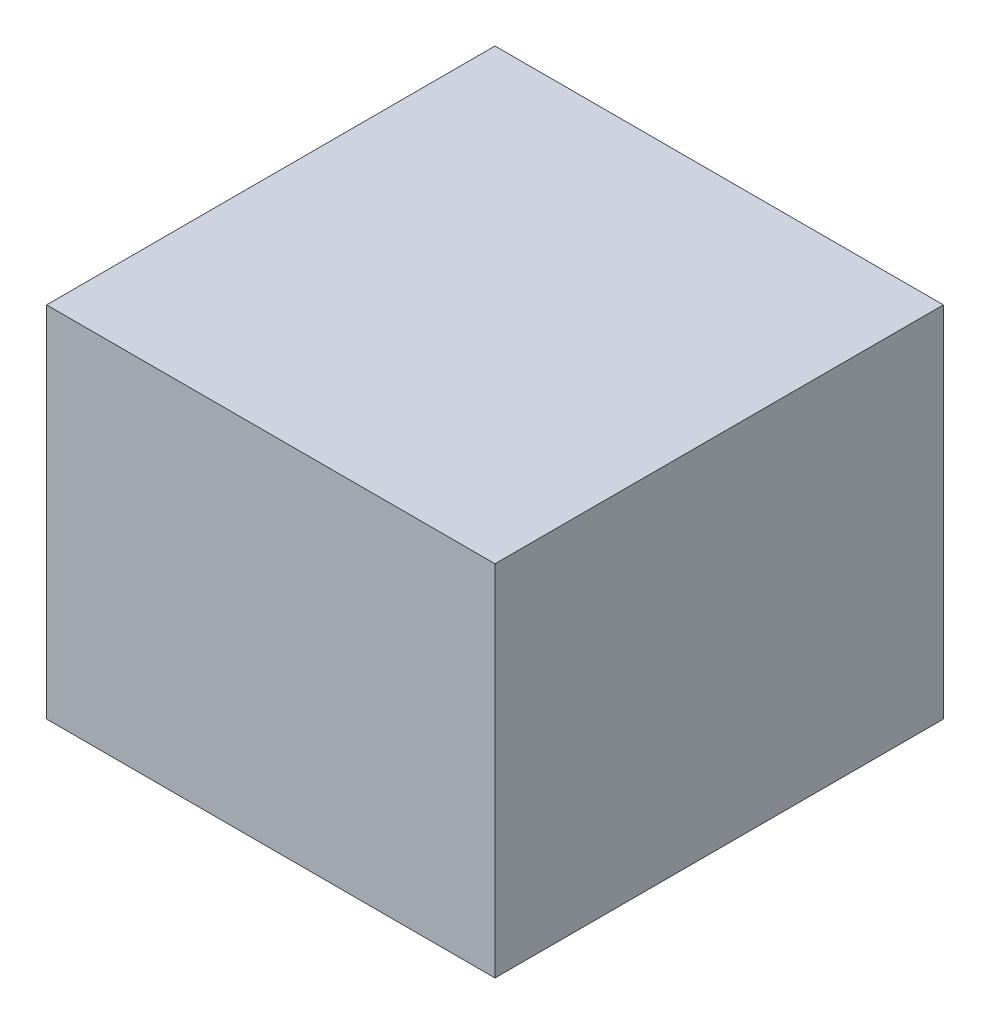
ISO-10303-21;
HEADER;
FILE_DESCRIPTION(('STEP AP214'),'2;1');
FILE_NAME('part.step','',(''),(''),'','','');
FILE_SCHEMA(('AUTOMOTIVE_DESIGN { 1 0 10303 214 1 1 1 1 }'));
ENDSEC;
DATA;
#1=APPLICATION_CONTEXT('core data for automotive mechanical design processes');
#2=APPLICATION_PROTOCOL_DEFINITION('international standard','automotive_design',2000,#1);
#3=PRODUCT_CONTEXT('',#1,'mechanical');
#4=PRODUCT('Part','Part','',(#3));
#5=PRODUCT_RELATED_PRODUCT_CATEGORY('part','',(#4));
#6=PRODUCT_DEFINITION_FORMATION('','',#4);
#7=PRODUCT_DEFINITION_CONTEXT('part definition',#1,'design');
#8=PRODUCT_DEFINITION('design','',#6,#7);
#9=PRODUCT_DEFINITION_SHAPE('','',#8);
#10=(LENGTH_UNIT() NAMED_UNIT(*) SI_UNIT(.MILLI.,.METRE.));
#11=(NAMED_UNIT(*) PLANE_ANGLE_UNIT() SI_UNIT($,.RADIAN.));
#12=(NAMED_UNIT(*) SI_UNIT($,.STERADIAN.) SOLID_ANGLE_UNIT());
#13=UNCERTAINTY_MEASURE_WITH_UNIT(LENGTH_MEASURE(1.E-05),#10,'distance_accuracy_value','');
#14=(GEOMETRIC_REPRESENTATION_CONTEXT(3) GLOBAL_UNCERTAINTY_ASSIGNED_CONTEXT((#13)) GLOBAL_UNIT_ASSIGNED_CONTEXT((#10,
#11,#12)) REPRESENTATION_CONTEXT('',''));
#15=CARTESIAN_POINT('',(0.,0.,0.));
#16=DIRECTION('',(0.,0.,1.));
#17=DIRECTION('',(1.,0.,0.));
#18=AXIS2_PLACEMENT_3D('',#15,#16,#17);
#19=CARTESIAN_POINT('',(0.,80.,0.));
#20=DIRECTION('',(1.,0.,0.));
#21=DIRECTION('',(0.,0.,-1.));
#22=AXIS2_PLACEMENT_3D('',#19,#20,#21);
#23=PLANE('',#22);
#24=DIRECTION('',(0.,0.,1.));
#25=VECTOR('',#24,1.);
#26=CARTESIAN_POINT('',(0.,0.,0.));
#27=LINE('',#26,#25);
#28=CARTESIAN_POINT('',(0.,0.,-100.));
#29=VERTEX_POINT('',#28);
#30=CARTESIAN_POINT('',(0.,0.,0.));
#31=VERTEX_POINT('',#30);
#32=EDGE_CURVE('E76',#29,#31,#27,.T.);
#33=ORIENTED_EDGE('',*,*,#32,.T.);
#34=DIRECTION('',(0.,-1.,0.));
#35=VECTOR('',#34,1.);
#36=CARTESIAN_POINT('',(0.,80.,0.));
#37=LINE('',#36,#35);
#38=CARTESIAN_POINT('',(0.,80.,0.));
#39=VERTEX_POINT('',#38);
#40=EDGE_CURVE('E11',#39,#31,#37,.T.);
#41=ORIENTED_EDGE('',*,*,#40,.F.);
#42=DIRECTION('',(0.,0.,1.));
#43=VECTOR('',#42,1.);
#44=CARTESIAN_POINT('',(0.,80.,0.));
#45=LINE('',#44,#43);
#46=CARTESIAN_POINT('',(0.,80.,-100.));
#47=VERTEX_POINT('',#46);
#48=EDGE_CURVE('E94',#47,#39,#45,.T.);
#49=ORIENTED_EDGE('',*,*,#48,.F.);
#50=DIRECTION('',(0.,-1.,0.));
#51=VECTOR('',#50,1.);
#52=CARTESIAN_POINT('',(0.,80.,-100.));
#53=LINE('',#52,#51);
#54=EDGE_CURVE('E88',#47,#29,#53,.T.);
#55=ORIENTED_EDGE('',*,*,#54,.T.);
#56=EDGE_LOOP('',(#33,#41,#49,#55));
#57=FACE_BOUND('',#56,.T.);
#58=ADVANCED_FACE('F32',(#57),#23,.F.);
#59=CARTESIAN_POINT('',(0.,80.,0.));
#60=DIRECTION('',(0.,0.,-1.));
#61=DIRECTION('',(-1.,0.,0.));
#62=AXIS2_PLACEMENT_3D('',#59,#60,#61);
#63=PLANE('',#62);
#64=DIRECTION('',(1.,0.,0.));
#65=VECTOR('',#64,1.);
#66=CARTESIAN_POINT('',(0.,0.,0.));
#67=LINE('',#66,#65);
#68=CARTESIAN_POINT('',(100.,0.,0.));
#69=VERTEX_POINT('',#68);
#70=EDGE_CURVE('E72',#31,#69,#67,.T.);
#71=ORIENTED_EDGE('',*,*,#70,.T.);
#72=DIRECTION('',(0.,-1.,0.));
#73=VECTOR('',#72,1.);
#74=CARTESIAN_POINT('',(100.,80.,0.));
#75=LINE('',#74,#73);
#76=CARTESIAN_POINT('',(100.,80.,0.));
#77=VERTEX_POINT('',#76);
#78=EDGE_CURVE('E39',#77,#69,#75,.T.);
#79=ORIENTED_EDGE('',*,*,#78,.F.);
#80=DIRECTION('',(1.,0.,0.));
#81=VECTOR('',#80,1.);
#82=CARTESIAN_POINT('',(0.,80.,0.));
#83=LINE('',#82,#81);
#84=EDGE_CURVE('E84',#39,#77,#83,.T.);
#85=ORIENTED_EDGE('',*,*,#84,.F.);
#86=ORIENTED_EDGE('',*,*,#40,.T.);
#87=EDGE_LOOP('',(#71,#79,#85,#86));
#88=FACE_BOUND('',#87,.T.);
#89=ADVANCED_FACE('F83',(#88),#63,.F.);
#90=CARTESIAN_POINT('',(100.,80.,0.));
#91=DIRECTION('',(-1.,0.,0.));
#92=DIRECTION('',(0.,0.,1.));
#93=AXIS2_PLACEMENT_3D('',#90,#91,#92);
#94=PLANE('',#93);
#95=DIRECTION('',(0.,0.,-1.));
#96=VECTOR('',#95,1.);
#97=CARTESIAN_POINT('',(100.,0.,0.));
#98=LINE('',#97,#96);
#99=CARTESIAN_POINT('',(100.,0.,-100.));
#100=VERTEX_POINT('',#99);
#101=EDGE_CURVE('E77',#69,#100,#98,.T.);
#102=ORIENTED_EDGE('',*,*,#101,.T.);
#103=DIRECTION('',(0.,-1.,0.));
#104=VECTOR('',#103,1.);
#105=CARTESIAN_POINT('',(100.,80.,-100.));
#106=LINE('',#105,#104);
#107=CARTESIAN_POINT('',(100.,80.,-100.));
#108=VERTEX_POINT('',#107);
#109=EDGE_CURVE('E100',#108,#100,#106,.T.);
#110=ORIENTED_EDGE('',*,*,#109,.F.);
#111=DIRECTION('',(0.,0.,-1.));
#112=VECTOR('',#111,1.);
#113=CARTESIAN_POINT('',(100.,80.,0.));
#114=LINE('',#113,#112);
#115=EDGE_CURVE('E51',#77,#108,#114,.T.);
#116=ORIENTED_EDGE('',*,*,#115,.F.);
#117=ORIENTED_EDGE('',*,*,#78,.T.);
#118=EDGE_LOOP('',(#102,#110,#116,#117));
#119=FACE_BOUND('',#118,.T.);
#120=ADVANCED_FACE('F103',(#119),#94,.F.);
#121=CARTESIAN_POINT('',(0.,80.,-100.));
#122=DIRECTION('',(0.,0.,1.));
#123=DIRECTION('',(1.,0.,0.));
#124=AXIS2_PLACEMENT_3D('',#121,#122,#123);
#125=PLANE('',#124);
#126=DIRECTION('',(-1.,0.,0.));
#127=VECTOR('',#126,1.);
#128=CARTESIAN_POINT('',(0.,0.,-100.));
#129=LINE('',#128,#127);
#130=EDGE_CURVE('E92',#100,#29,#129,.T.);
#131=ORIENTED_EDGE('',*,*,#130,.T.);
#132=ORIENTED_EDGE('',*,*,#54,.F.);
#133=DIRECTION('',(-1.,0.,0.));
#134=VECTOR('',#133,1.);
#135=CARTESIAN_POINT('',(0.,80.,-100.));
#136=LINE('',#135,#134);
#137=EDGE_CURVE('E46',#108,#47,#136,.T.);
#138=ORIENTED_EDGE('',*,*,#137,.F.);
#139=ORIENTED_EDGE('',*,*,#109,.T.);
#140=EDGE_LOOP('',(#131,#132,#138,#139));
#141=FACE_BOUND('',#140,.T.);
#142=ADVANCED_FACE('F105',(#141),#125,.F.);
#143=CARTESIAN_POINT('',(0.,80.,-100.));
#144=DIRECTION('',(0.,-1.,0.));
#145=DIRECTION('',(0.,0.,-1.));
#146=AXIS2_PLACEMENT_3D('',#143,#144,#145);
#147=PLANE('',#146);
#148=ORIENTED_EDGE('',*,*,#48,.T.);
#149=ORIENTED_EDGE('',*,*,#84,.T.);
#150=ORIENTED_EDGE('',*,*,#115,.T.);
#151=ORIENTED_EDGE('',*,*,#137,.T.);
#152=EDGE_LOOP('',(#148,#149,#150,#151));
#153=FACE_BOUND('',#152,.T.);
#154=ADVANCED_FACE('F106',(#153),#147,.F.);
#155=CARTESIAN_POINT('',(0.,0.,-100.));
#156=DIRECTION('',(0.,-1.,0.));
#157=DIRECTION('',(0.,0.,-1.));
#158=AXIS2_PLACEMENT_3D('',#155,#156,#157);
#159=PLANE('',#158);
#160=ORIENTED_EDGE('',*,*,#32,.F.);
#161=ORIENTED_EDGE('',*,*,#130,.F.);
#162=ORIENTED_EDGE('',*,*,#101,.F.);
#163=ORIENTED_EDGE('',*,*,#70,.F.);
#164=EDGE_LOOP('',(#160,#161,#162,#163));
#165=FACE_BOUND('',#164,.T.);
#166=ADVANCED_FACE('F73',(#165),#159,.T.);
#167=CLOSED_SHELL('',(#58,#89,#120,#142,#154,#166));
#168=MANIFOLD_SOLID_BREP('B2',#167);
#169=ADVANCED_BREP_SHAPE_REPRESENTATION('',(#18,#168),#14);
#170=SHAPE_DEFINITION_REPRESENTATION(#9,#169);
ENDSEC;
END-ISO-10303-21;
